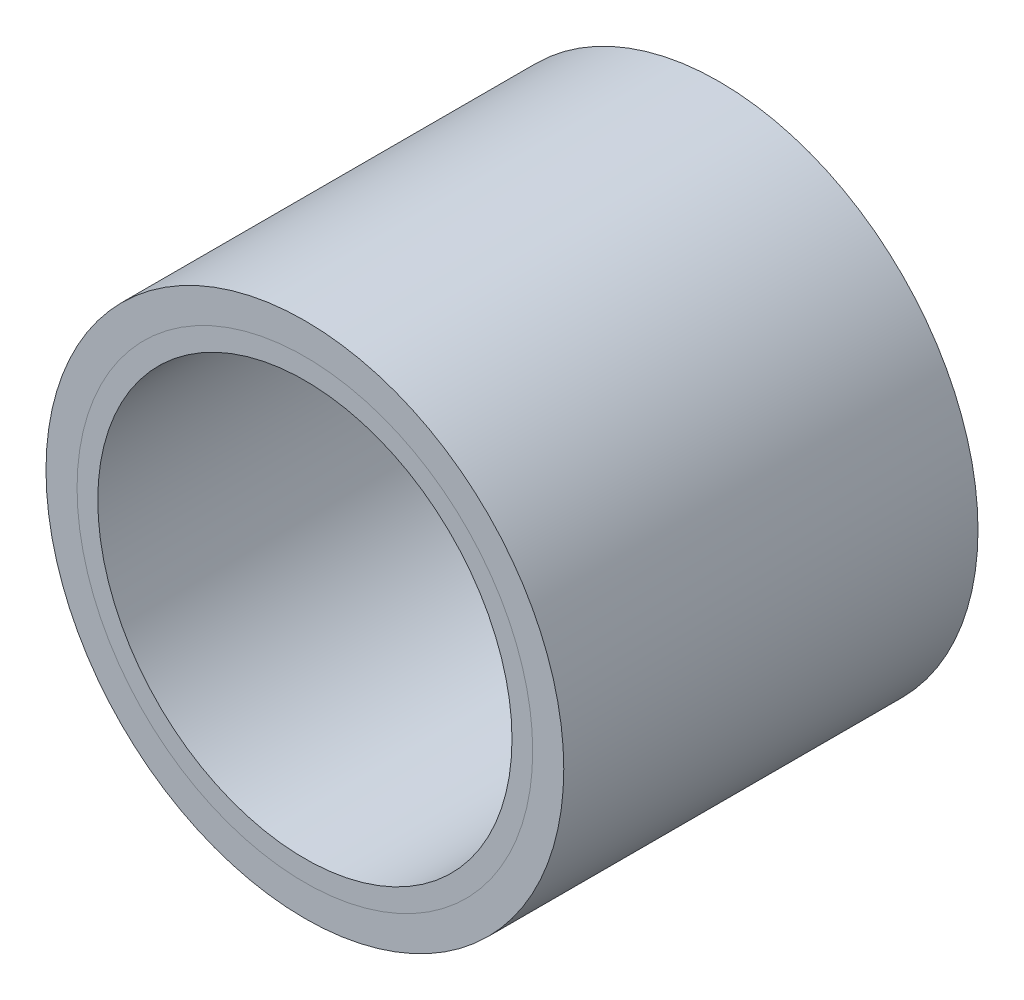
ISO-10303-21;
HEADER;
FILE_DESCRIPTION(('STEP AP214'),'2;1');
FILE_NAME('part.step','',(''),(''),'','','');
FILE_SCHEMA(('AUTOMOTIVE_DESIGN { 1 0 10303 214 1 1 1 1 }'));
ENDSEC;
DATA;
#1=APPLICATION_CONTEXT('core data for automotive mechanical design processes');
#2=APPLICATION_PROTOCOL_DEFINITION('international standard','automotive_design',2000,#1);
#3=PRODUCT_CONTEXT('',#1,'mechanical');
#4=PRODUCT('Part','Part','',(#3));
#5=PRODUCT_RELATED_PRODUCT_CATEGORY('part','',(#4));
#6=PRODUCT_DEFINITION_FORMATION('','',#4);
#7=PRODUCT_DEFINITION_CONTEXT('part definition',#1,'design');
#8=PRODUCT_DEFINITION('design','',#6,#7);
#9=PRODUCT_DEFINITION_SHAPE('','',#8);
#10=(LENGTH_UNIT() NAMED_UNIT(*) SI_UNIT(.MILLI.,.METRE.));
#11=(NAMED_UNIT(*) PLANE_ANGLE_UNIT() SI_UNIT($,.RADIAN.));
#12=(NAMED_UNIT(*) SI_UNIT($,.STERADIAN.) SOLID_ANGLE_UNIT());
#13=UNCERTAINTY_MEASURE_WITH_UNIT(LENGTH_MEASURE(1.E-05),#10,'distance_accuracy_value','');
#14=(GEOMETRIC_REPRESENTATION_CONTEXT(3) GLOBAL_UNCERTAINTY_ASSIGNED_CONTEXT((#13)) GLOBAL_UNIT_ASSIGNED_CONTEXT((#10,
#11,#12)) REPRESENTATION_CONTEXT('',''));
#15=CARTESIAN_POINT('',(0.,0.,0.));
#16=DIRECTION('',(0.,0.,1.));
#17=DIRECTION('',(1.,0.,0.));
#18=AXIS2_PLACEMENT_3D('',#15,#16,#17);
#19=CARTESIAN_POINT('',(0.,0.,-10.));
#20=DIRECTION('',(0.,0.,1.));
#21=DIRECTION('',(1.,0.,0.));
#22=AXIS2_PLACEMENT_3D('',#19,#20,#21);
#23=CYLINDRICAL_SURFACE('',#22,12.5);
#24=CARTESIAN_POINT('',(0.,0.,-10.));
#25=DIRECTION('',(0.,0.,1.));
#26=DIRECTION('',(1.,0.,0.));
#27=AXIS2_PLACEMENT_3D('',#24,#25,#26);
#28=CIRCLE('',#27,12.5);
#29=CARTESIAN_POINT('',(12.5,0.,-10.));
#30=VERTEX_POINT('',#29);
#31=EDGE_CURVE('E11',#30,#30,#28,.T.);
#32=ORIENTED_EDGE('',*,*,#31,.T.);
#33=EDGE_LOOP('',(#32));
#34=FACE_BOUND('',#33,.T.);
#35=CARTESIAN_POINT('',(0.,0.,10.));
#36=DIRECTION('',(0.,0.,1.));
#37=DIRECTION('',(1.,0.,0.));
#38=AXIS2_PLACEMENT_3D('',#35,#36,#37);
#39=CIRCLE('',#38,12.5);
#40=CARTESIAN_POINT('',(12.5,0.,10.));
#41=VERTEX_POINT('',#40);
#42=EDGE_CURVE('E46',#41,#41,#39,.T.);
#43=ORIENTED_EDGE('',*,*,#42,.F.);
#44=EDGE_LOOP('',(#43));
#45=FACE_BOUND('',#44,.T.);
#46=ADVANCED_FACE('F43',(#34,#45),#23,.T.);
#47=CARTESIAN_POINT('',(0.,0.,-10.));
#48=DIRECTION('',(0.,0.,1.));
#49=DIRECTION('',(1.,0.,0.));
#50=AXIS2_PLACEMENT_3D('',#47,#48,#49);
#51=PLANE('',#50);
#52=CARTESIAN_POINT('',(0.,0.,-10.));
#53=DIRECTION('',(0.,0.,1.));
#54=DIRECTION('',(1.,0.,0.));
#55=AXIS2_PLACEMENT_3D('',#52,#53,#54);
#56=CIRCLE('',#55,11.);
#57=CARTESIAN_POINT('',(11.,0.,-10.));
#58=VERTEX_POINT('',#57);
#59=EDGE_CURVE('E53',#58,#58,#56,.T.);
#60=ORIENTED_EDGE('',*,*,#59,.T.);
#61=EDGE_LOOP('',(#60));
#62=FACE_BOUND('',#61,.T.);
#63=ORIENTED_EDGE('',*,*,#31,.F.);
#64=EDGE_LOOP('',(#63));
#65=FACE_BOUND('',#64,.T.);
#66=ADVANCED_FACE('F61',(#62,#65),#51,.F.);
#67=CARTESIAN_POINT('',(0.,0.,10.));
#68=DIRECTION('',(0.,0.,1.));
#69=DIRECTION('',(1.,0.,0.));
#70=AXIS2_PLACEMENT_3D('',#67,#68,#69);
#71=PLANE('',#70);
#72=CARTESIAN_POINT('',(0.,0.,10.));
#73=DIRECTION('',(0.,0.,1.));
#74=DIRECTION('',(1.,0.,0.));
#75=AXIS2_PLACEMENT_3D('',#72,#73,#74);
#76=CIRCLE('',#75,11.);
#77=CARTESIAN_POINT('',(11.,0.,10.));
#78=VERTEX_POINT('',#77);
#79=EDGE_CURVE('E55',#78,#78,#76,.T.);
#80=ORIENTED_EDGE('',*,*,#79,.F.);
#81=EDGE_LOOP('',(#80));
#82=FACE_BOUND('',#81,.T.);
#83=ORIENTED_EDGE('',*,*,#42,.T.);
#84=EDGE_LOOP('',(#83));
#85=FACE_BOUND('',#84,.T.);
#86=ADVANCED_FACE('F67',(#82,#85),#71,.T.);
#87=CARTESIAN_POINT('',(0.,0.,-10.));
#88=DIRECTION('',(0.,0.,1.));
#89=DIRECTION('',(1.,0.,0.));
#90=AXIS2_PLACEMENT_3D('',#87,#88,#89);
#91=CYLINDRICAL_SURFACE('',#90,11.);
#92=ORIENTED_EDGE('',*,*,#59,.F.);
#93=EDGE_LOOP('',(#92));
#94=FACE_BOUND('',#93,.T.);
#95=ORIENTED_EDGE('',*,*,#79,.T.);
#96=EDGE_LOOP('',(#95));
#97=FACE_BOUND('',#96,.T.);
#98=ADVANCED_FACE('F64',(#94,#97),#91,.F.);
#99=CLOSED_SHELL('',(#46,#66,#86,#98));
#100=MANIFOLD_SOLID_BREP('B2',#99);
#101=CARTESIAN_POINT('',(0.,0.,10.));
#102=DIRECTION('',(0.,0.,1.));
#103=DIRECTION('',(1.,0.,0.));
#104=AXIS2_PLACEMENT_3D('',#101,#102,#103);
#105=PLANE('',#104);
#106=CARTESIAN_POINT('',(0.,0.,10.));
#107=DIRECTION('',(0.,0.,1.));
#108=DIRECTION('',(1.,0.,0.));
#109=AXIS2_PLACEMENT_3D('',#106,#107,#108);
#110=CIRCLE('',#109,11.);
#111=CARTESIAN_POINT('',(11.,0.,10.));
#112=VERTEX_POINT('',#111);
#113=EDGE_CURVE('E42',#112,#112,#110,.T.);
#114=ORIENTED_EDGE('',*,*,#113,.T.);
#115=EDGE_LOOP('',(#114));
#116=FACE_BOUND('',#115,.T.);
#117=CARTESIAN_POINT('',(0.,0.,10.));
#118=DIRECTION('',(0.,0.,1.));
#119=DIRECTION('',(1.,0.,0.));
#120=AXIS2_PLACEMENT_3D('',#117,#118,#119);
#121=CIRCLE('',#120,10.);
#122=CARTESIAN_POINT('',(10.,0.,10.));
#123=VERTEX_POINT('',#122);
#124=EDGE_CURVE('E116',#123,#123,#121,.T.);
#125=ORIENTED_EDGE('',*,*,#124,.F.);
#126=EDGE_LOOP('',(#125));
#127=FACE_BOUND('',#126,.T.);
#128=ADVANCED_FACE('F105',(#116,#127),#105,.T.);
#129=CARTESIAN_POINT('',(0.,0.,-10.));
#130=DIRECTION('',(0.,0.,1.));
#131=DIRECTION('',(1.,0.,0.));
#132=AXIS2_PLACEMENT_3D('',#129,#130,#131);
#133=PLANE('',#132);
#134=CARTESIAN_POINT('',(0.,0.,-10.));
#135=DIRECTION('',(0.,0.,1.));
#136=DIRECTION('',(1.,0.,0.));
#137=AXIS2_PLACEMENT_3D('',#134,#135,#136);
#138=CIRCLE('',#137,11.);
#139=CARTESIAN_POINT('',(11.,0.,-10.));
#140=VERTEX_POINT('',#139);
#141=EDGE_CURVE('E109',#140,#140,#138,.T.);
#142=ORIENTED_EDGE('',*,*,#141,.F.);
#143=EDGE_LOOP('',(#142));
#144=FACE_BOUND('',#143,.T.);
#145=CARTESIAN_POINT('',(0.,0.,-10.));
#146=DIRECTION('',(0.,0.,1.));
#147=DIRECTION('',(1.,0.,0.));
#148=AXIS2_PLACEMENT_3D('',#145,#146,#147);
#149=CIRCLE('',#148,10.);
#150=CARTESIAN_POINT('',(10.,0.,-10.));
#151=VERTEX_POINT('',#150);
#152=EDGE_CURVE('E118',#151,#151,#149,.T.);
#153=ORIENTED_EDGE('',*,*,#152,.T.);
#154=EDGE_LOOP('',(#153));
#155=FACE_BOUND('',#154,.T.);
#156=ADVANCED_FACE('F128',(#144,#155),#133,.F.);
#157=CARTESIAN_POINT('',(0.,0.,10.));
#158=DIRECTION('',(0.,0.,-1.));
#159=DIRECTION('',(-1.,0.,0.));
#160=AXIS2_PLACEMENT_3D('',#157,#158,#159);
#161=CYLINDRICAL_SURFACE('',#160,11.);
#162=ORIENTED_EDGE('',*,*,#113,.F.);
#163=EDGE_LOOP('',(#162));
#164=FACE_BOUND('',#163,.T.);
#165=ORIENTED_EDGE('',*,*,#141,.T.);
#166=EDGE_LOOP('',(#165));
#167=FACE_BOUND('',#166,.T.);
#168=ADVANCED_FACE('F107',(#164,#167),#161,.T.);
#169=CARTESIAN_POINT('',(0.,0.,10.));
#170=DIRECTION('',(0.,0.,-1.));
#171=DIRECTION('',(-1.,0.,0.));
#172=AXIS2_PLACEMENT_3D('',#169,#170,#171);
#173=CYLINDRICAL_SURFACE('',#172,10.);
#174=ORIENTED_EDGE('',*,*,#124,.T.);
#175=EDGE_LOOP('',(#174));
#176=FACE_BOUND('',#175,.T.);
#177=ORIENTED_EDGE('',*,*,#152,.F.);
#178=EDGE_LOOP('',(#177));
#179=FACE_BOUND('',#178,.T.);
#180=ADVANCED_FACE('F124',(#176,#179),#173,.F.);
#181=CLOSED_SHELL('',(#128,#156,#168,#180));
#182=MANIFOLD_SOLID_BREP('B6',#181);
#183=ADVANCED_BREP_SHAPE_REPRESENTATION('',(#18,#100,#182),#14);
#184=SHAPE_DEFINITION_REPRESENTATION(#9,#183);
ENDSEC;
END-ISO-10303-21;
